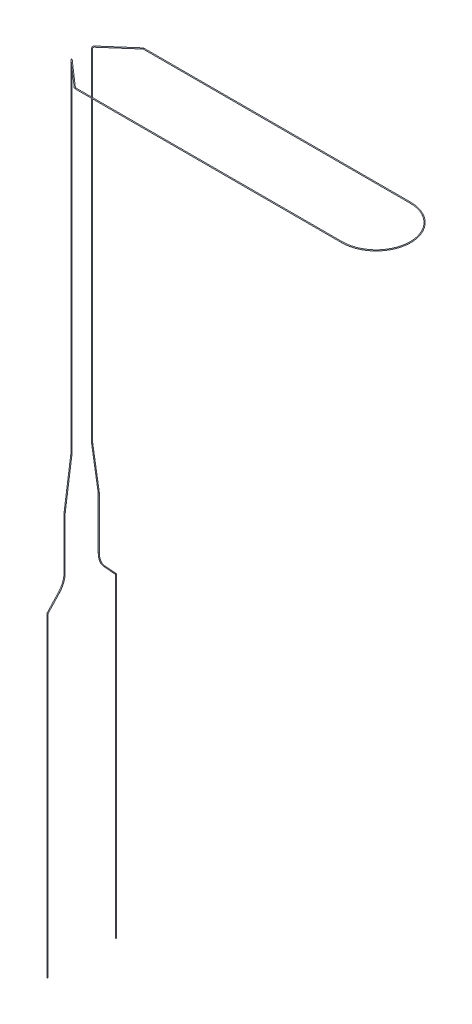
ISO-10303-21;
HEADER;
FILE_DESCRIPTION(('STEP AP214'),'2;1');
FILE_NAME('part.step','',(''),(''),'','','');
FILE_SCHEMA(('AUTOMOTIVE_DESIGN { 1 0 10303 214 1 1 1 1 }'));
ENDSEC;
DATA;
#1=APPLICATION_CONTEXT('core data for automotive mechanical design processes');
#2=APPLICATION_PROTOCOL_DEFINITION('international standard','automotive_design',2000,#1);
#3=PRODUCT_CONTEXT('',#1,'mechanical');
#4=PRODUCT('Part','Part','',(#3));
#5=PRODUCT_RELATED_PRODUCT_CATEGORY('part','',(#4));
#6=PRODUCT_DEFINITION_FORMATION('','',#4);
#7=PRODUCT_DEFINITION_CONTEXT('part definition',#1,'design');
#8=PRODUCT_DEFINITION('design','',#6,#7);
#9=PRODUCT_DEFINITION_SHAPE('','',#8);
#10=(LENGTH_UNIT() NAMED_UNIT(*) SI_UNIT(.MILLI.,.METRE.));
#11=(NAMED_UNIT(*) PLANE_ANGLE_UNIT() SI_UNIT($,.RADIAN.));
#12=(NAMED_UNIT(*) SI_UNIT($,.STERADIAN.) SOLID_ANGLE_UNIT());
#13=UNCERTAINTY_MEASURE_WITH_UNIT(LENGTH_MEASURE(1.E-05),#10,'distance_accuracy_value','');
#14=(GEOMETRIC_REPRESENTATION_CONTEXT(3) GLOBAL_UNCERTAINTY_ASSIGNED_CONTEXT((#13)) GLOBAL_UNIT_ASSIGNED_CONTEXT((#10,
#11,#12)) REPRESENTATION_CONTEXT('',''));
#15=CARTESIAN_POINT('',(0.,0.,0.));
#16=DIRECTION('',(0.,0.,1.));
#17=DIRECTION('',(1.,0.,0.));
#18=AXIS2_PLACEMENT_3D('',#15,#16,#17);
#19=CARTESIAN_POINT('',(0.,-200.,20.));
#20=DIRECTION('',(0.,-1.,0.));
#21=DIRECTION('',(-1.,0.,0.));
#22=AXIS2_PLACEMENT_3D('',#19,#20,#21);
#23=PLANE('',#22);
#24=CARTESIAN_POINT('',(0.,-200.,20.));
#25=DIRECTION('',(0.,-1.,0.));
#26=DIRECTION('',(-1.,0.,0.));
#27=AXIS2_PLACEMENT_3D('',#24,#25,#26);
#28=CIRCLE('',#27,0.25);
#29=CARTESIAN_POINT('',(-0.249999999999906,-200.,20.));
#30=VERTEX_POINT('',#29);
#31=EDGE_CURVE('E172',#30,#30,#28,.T.);
#32=ORIENTED_EDGE('',*,*,#31,.T.);
#33=EDGE_LOOP('',(#32));
#34=FACE_BOUND('',#33,.T.);
#35=ADVANCED_FACE('F49',(#34),#23,.T.);
#36=CARTESIAN_POINT('',(0.,-200.,-20.));
#37=DIRECTION('',(0.,1.,0.));
#38=DIRECTION('',(-1.,0.,0.));
#39=AXIS2_PLACEMENT_3D('',#36,#37,#38);
#40=PLANE('',#39);
#41=CARTESIAN_POINT('',(0.,-200.,-20.));
#42=DIRECTION('',(0.,1.,0.));
#43=DIRECTION('',(-1.,0.,0.));
#44=AXIS2_PLACEMENT_3D('',#41,#42,#43);
#45=CIRCLE('',#44,0.25);
#46=CARTESIAN_POINT('',(-0.249999999999906,-200.,-20.));
#47=VERTEX_POINT('',#46);
#48=EDGE_CURVE('E11',#47,#47,#45,.T.);
#49=ORIENTED_EDGE('',*,*,#48,.F.);
#50=EDGE_LOOP('',(#49));
#51=FACE_BOUND('',#50,.T.);
#52=ADVANCED_FACE('F181',(#51),#40,.F.);
#53=CARTESIAN_POINT('',(0.,-200.,20.));
#54=DIRECTION('',(0.,1.,0.));
#55=DIRECTION('',(-1.,0.,0.));
#56=AXIS2_PLACEMENT_3D('',#53,#54,#55);
#57=CYLINDRICAL_SURFACE('',#56,0.25);
#58=CARTESIAN_POINT('',(0.,-16.2259715403941,20.));
#59=DIRECTION('',(0.,-1.,0.));
#60=DIRECTION('',(-1.,0.,0.));
#61=AXIS2_PLACEMENT_3D('',#58,#59,#60);
#62=CIRCLE('',#61,0.25);
#63=CARTESIAN_POINT('',(0.,-16.2259715403941,20.25));
#64=VERTEX_POINT('',#63);
#65=EDGE_CURVE('E168',#64,#64,#62,.T.);
#66=ORIENTED_EDGE('',*,*,#65,.T.);
#67=EDGE_LOOP('',(#66));
#68=FACE_BOUND('',#67,.T.);
#69=ORIENTED_EDGE('',*,*,#31,.F.);
#70=EDGE_LOOP('',(#69));
#71=FACE_BOUND('',#70,.T.);
#72=ADVANCED_FACE('F178',(#68,#71),#57,.T.);
#73=CARTESIAN_POINT('',(0.,-16.2259715403941,19.));
#74=DIRECTION('',(-1.,0.,0.));
#75=DIRECTION('',(0.,0.,1.));
#76=AXIS2_PLACEMENT_3D('',#73,#74,#75);
#77=TOROIDAL_SURFACE('',#76,1.,0.25);
#78=CARTESIAN_POINT('',(0.,-15.5476836140616,19.7347962227662));
#79=DIRECTION('',(0.,-0.734796222766241,0.678287926332516));
#80=DIRECTION('',(-1.,0.,0.));
#81=AXIS2_PLACEMENT_3D('',#78,#79,#80);
#82=CIRCLE('',#81,0.25);
#83=CARTESIAN_POINT('',(0.,-15.3781116324784,19.9184952784578));
#84=VERTEX_POINT('',#83);
#85=EDGE_CURVE('E164',#84,#84,#82,.T.);
#86=CARTESIAN_POINT('',(0.,-16.2259715403941,19.));
#87=DIRECTION('',(-1.,0.,0.));
#88=DIRECTION('',(0.,0.,1.));
#89=AXIS2_PLACEMENT_3D('',#86,#87,#88);
#90=CIRCLE('',#89,1.25);
#91=EDGE_CURVE('',#64,#84,#90,.T.);
#92=ORIENTED_EDGE('',*,*,#65,.F.);
#93=ORIENTED_EDGE('',*,*,#85,.T.);
#94=ORIENTED_EDGE('',*,*,#91,.T.);
#95=ORIENTED_EDGE('',*,*,#91,.F.);
#96=EDGE_LOOP('',(#92,#94,#93,#95));
#97=FACE_BOUND('',#96,.T.);
#98=ADVANCED_FACE('F180',(#97),#77,.T.);
#99=CARTESIAN_POINT('',(0.,-15.5476836140616,19.7347962227662));
#100=DIRECTION('',(0.,0.734796222766239,-0.678287926332518));
#101=DIRECTION('',(0.,0.678287926332518,0.734796222766239));
#102=AXIS2_PLACEMENT_3D('',#99,#100,#101);
#103=CYLINDRICAL_SURFACE('',#102,0.25);
#104=CARTESIAN_POINT('',(0.,-8.44945511599021,13.1824453268051));
#105=DIRECTION('',(0.,-0.734796222766239,0.678287926332518));
#106=DIRECTION('',(-1.,0.,0.));
#107=AXIS2_PLACEMENT_3D('',#104,#105,#106);
#108=CIRCLE('',#107,0.25);
#109=CARTESIAN_POINT('',(0.,-8.61902709757335,12.9987462711136));
#110=VERTEX_POINT('',#109);
#111=EDGE_CURVE('E160',#110,#110,#108,.T.);
#112=ORIENTED_EDGE('',*,*,#111,.T.);
#113=EDGE_LOOP('',(#112));
#114=FACE_BOUND('',#113,.T.);
#115=ORIENTED_EDGE('',*,*,#85,.F.);
#116=EDGE_LOOP('',(#115));
#117=FACE_BOUND('',#116,.T.);
#118=ADVANCED_FACE('F188',(#114,#117),#103,.T.);
#119=CARTESIAN_POINT('',(0.,-0.309999999999999,22.));
#120=DIRECTION('',(1.,0.,0.));
#121=DIRECTION('',(0.,0.,-1.));
#122=AXIS2_PLACEMENT_3D('',#119,#120,#121);
#123=TOROIDAL_SURFACE('',#122,12.,0.25);
#124=CARTESIAN_POINT('',(0.,-0.310000000000005,10.));
#125=DIRECTION('',(0.,-1.,0.));
#126=DIRECTION('',(-1.,0.,0.));
#127=AXIS2_PLACEMENT_3D('',#124,#125,#126);
#128=CIRCLE('',#127,0.25);
#129=CARTESIAN_POINT('',(0.,-0.310000000000005,9.75));
#130=VERTEX_POINT('',#129);
#131=EDGE_CURVE('E156',#130,#130,#128,.T.);
#132=CARTESIAN_POINT('',(0.,-0.309999999999999,22.));
#133=DIRECTION('',(1.,0.,0.));
#134=DIRECTION('',(0.,0.,-1.));
#135=AXIS2_PLACEMENT_3D('',#132,#133,#134);
#136=CIRCLE('',#135,12.25);
#137=EDGE_CURVE('',#110,#130,#136,.T.);
#138=ORIENTED_EDGE('',*,*,#111,.F.);
#139=ORIENTED_EDGE('',*,*,#131,.T.);
#140=ORIENTED_EDGE('',*,*,#137,.T.);
#141=ORIENTED_EDGE('',*,*,#137,.F.);
#142=EDGE_LOOP('',(#138,#140,#139,#141));
#143=FACE_BOUND('',#142,.T.);
#144=ADVANCED_FACE('F293',(#143),#123,.T.);
#145=CARTESIAN_POINT('',(0.,-0.310000000000005,10.));
#146=DIRECTION('',(0.,1.,0.));
#147=DIRECTION('',(-1.,0.,0.));
#148=AXIS2_PLACEMENT_3D('',#145,#146,#147);
#149=CYLINDRICAL_SURFACE('',#148,0.25);
#150=CARTESIAN_POINT('',(0.,0.,10.));
#151=DIRECTION('',(0.,-1.,0.));
#152=DIRECTION('',(-1.,0.,0.));
#153=AXIS2_PLACEMENT_3D('',#150,#151,#152);
#154=CIRCLE('',#153,0.25);
#155=CARTESIAN_POINT('',(-0.249999999999996,0.,10.));
#156=VERTEX_POINT('',#155);
#157=EDGE_CURVE('E152',#156,#156,#154,.T.);
#158=ORIENTED_EDGE('',*,*,#157,.T.);
#159=EDGE_LOOP('',(#158));
#160=FACE_BOUND('',#159,.T.);
#161=ORIENTED_EDGE('',*,*,#131,.F.);
#162=EDGE_LOOP('',(#161));
#163=FACE_BOUND('',#162,.T.);
#164=ADVANCED_FACE('F289',(#160,#163),#149,.T.);
#165=CARTESIAN_POINT('',(0.,0.,10.));
#166=DIRECTION('',(0.,1.,0.));
#167=DIRECTION('',(-1.,0.,0.));
#168=AXIS2_PLACEMENT_3D('',#165,#166,#167);
#169=CYLINDRICAL_SURFACE('',#168,0.25);
#170=CARTESIAN_POINT('',(0.,29.2893218813453,10.));
#171=DIRECTION('',(0.,-1.,0.));
#172=DIRECTION('',(-1.,0.,0.));
#173=AXIS2_PLACEMENT_3D('',#170,#171,#172);
#174=CIRCLE('',#173,0.25);
#175=CARTESIAN_POINT('',(0.,29.2893218813453,10.25));
#176=VERTEX_POINT('',#175);
#177=EDGE_CURVE('E148',#176,#176,#174,.T.);
#178=ORIENTED_EDGE('',*,*,#177,.T.);
#179=EDGE_LOOP('',(#178));
#180=FACE_BOUND('',#179,.T.);
#181=ORIENTED_EDGE('',*,*,#157,.F.);
#182=EDGE_LOOP('',(#181));
#183=FACE_BOUND('',#182,.T.);
#184=ADVANCED_FACE('F285',(#180,#183),#169,.T.);
#185=CARTESIAN_POINT('',(0.,29.2893218813453,0.));
#186=DIRECTION('',(-1.,0.,0.));
#187=DIRECTION('',(0.,0.,1.));
#188=AXIS2_PLACEMENT_3D('',#185,#186,#187);
#189=TOROIDAL_SURFACE('',#188,10.,0.25);
#190=CARTESIAN_POINT('',(0.,30.7035354437183,9.89949493661167));
#191=DIRECTION('',(0.,-0.989949493661167,0.14142135623731));
#192=DIRECTION('',(-1.,0.,0.));
#193=AXIS2_PLACEMENT_3D('',#190,#191,#192);
#194=CIRCLE('',#193,0.25);
#195=CARTESIAN_POINT('',(0.,30.7388907827776,10.146982310027));
#196=VERTEX_POINT('',#195);
#197=EDGE_CURVE('E144',#196,#196,#194,.T.);
#198=CARTESIAN_POINT('',(0.,29.2893218813453,0.));
#199=DIRECTION('',(-1.,0.,0.));
#200=DIRECTION('',(0.,0.,1.));
#201=AXIS2_PLACEMENT_3D('',#198,#199,#200);
#202=CIRCLE('',#201,10.25);
#203=EDGE_CURVE('',#176,#196,#202,.T.);
#204=ORIENTED_EDGE('',*,*,#177,.F.);
#205=ORIENTED_EDGE('',*,*,#197,.T.);
#206=ORIENTED_EDGE('',*,*,#203,.T.);
#207=ORIENTED_EDGE('',*,*,#203,.F.);
#208=EDGE_LOOP('',(#204,#206,#205,#207));
#209=FACE_BOUND('',#208,.T.);
#210=ADVANCED_FACE('F281',(#209),#189,.T.);
#211=CARTESIAN_POINT('',(0.,30.7035354437183,9.89949493661167));
#212=DIRECTION('',(0.,0.989949493661166,-0.14142135623731));
#213=DIRECTION('',(0.,0.14142135623731,0.989949493661166));
#214=AXIS2_PLACEMENT_3D('',#211,#212,#213);
#215=CYLINDRICAL_SURFACE('',#214,0.25);
#216=CARTESIAN_POINT('',(0.,57.2964645562816,6.10050506338833));
#217=DIRECTION('',(0.,-0.989949493661167,0.14142135623731));
#218=DIRECTION('',(-1.,0.,0.));
#219=AXIS2_PLACEMENT_3D('',#216,#217,#218);
#220=CIRCLE('',#219,0.25);
#221=CARTESIAN_POINT('',(0.,57.2611092172223,5.85301768997304));
#222=VERTEX_POINT('',#221);
#223=EDGE_CURVE('E140',#222,#222,#220,.T.);
#224=ORIENTED_EDGE('',*,*,#223,.T.);
#225=EDGE_LOOP('',(#224));
#226=FACE_BOUND('',#225,.T.);
#227=ORIENTED_EDGE('',*,*,#197,.F.);
#228=EDGE_LOOP('',(#227));
#229=FACE_BOUND('',#228,.T.);
#230=ADVANCED_FACE('F277',(#226,#229),#215,.T.);
#231=CARTESIAN_POINT('',(0.,58.7106781186548,16.));
#232=DIRECTION('',(1.,0.,0.));
#233=DIRECTION('',(0.,0.,-1.));
#234=AXIS2_PLACEMENT_3D('',#231,#232,#233);
#235=TOROIDAL_SURFACE('',#234,9.99999999999999,0.25);
#236=CARTESIAN_POINT('',(0.,58.7106781186548,5.99999999999999));
#237=DIRECTION('',(0.,-1.,0.));
#238=DIRECTION('',(-1.,0.,0.));
#239=AXIS2_PLACEMENT_3D('',#236,#237,#238);
#240=CIRCLE('',#239,0.25);
#241=CARTESIAN_POINT('',(0.,58.7106781186548,5.75));
#242=VERTEX_POINT('',#241);
#243=EDGE_CURVE('E136',#242,#242,#240,.T.);
#244=CARTESIAN_POINT('',(0.,58.7106781186548,16.));
#245=DIRECTION('',(1.,0.,0.));
#246=DIRECTION('',(0.,0.,-1.));
#247=AXIS2_PLACEMENT_3D('',#244,#245,#246);
#248=CIRCLE('',#247,10.25);
#249=EDGE_CURVE('',#222,#242,#248,.T.);
#250=ORIENTED_EDGE('',*,*,#223,.F.);
#251=ORIENTED_EDGE('',*,*,#243,.T.);
#252=ORIENTED_EDGE('',*,*,#249,.T.);
#253=ORIENTED_EDGE('',*,*,#249,.F.);
#254=EDGE_LOOP('',(#250,#252,#251,#253));
#255=FACE_BOUND('',#254,.T.);
#256=ADVANCED_FACE('F273',(#255),#235,.T.);
#257=CARTESIAN_POINT('',(0.,58.7106781186548,5.99999999999999));
#258=DIRECTION('',(0.,1.,0.));
#259=DIRECTION('',(-1.,0.,0.));
#260=AXIS2_PLACEMENT_3D('',#257,#258,#259);
#261=CYLINDRICAL_SURFACE('',#260,0.25);
#262=CARTESIAN_POINT('',(0.,257.,6.));
#263=DIRECTION('',(0.,-1.,0.));
#264=DIRECTION('',(-1.,0.,0.));
#265=AXIS2_PLACEMENT_3D('',#262,#263,#264);
#266=CIRCLE('',#265,0.25);
#267=CARTESIAN_POINT('',(-0.188144173676715,257.,5.83537384803287));
#268=VERTEX_POINT('',#267);
#269=EDGE_CURVE('E132',#268,#268,#266,.T.);
#270=ORIENTED_EDGE('',*,*,#269,.T.);
#271=EDGE_LOOP('',(#270));
#272=FACE_BOUND('',#271,.T.);
#273=ORIENTED_EDGE('',*,*,#243,.F.);
#274=EDGE_LOOP('',(#273));
#275=FACE_BOUND('',#274,.T.);
#276=ADVANCED_FACE('F269',(#272,#275),#261,.T.);
#277=CARTESIAN_POINT('',(0.752576694706892,257.,6.65850460786851));
#278=DIRECTION('',(0.658504607868518,0.,-0.752576694706878));
#279=DIRECTION('',(-0.752576694706878,0.,-0.658504607868518));
#280=AXIS2_PLACEMENT_3D('',#277,#278,#279);
#281=TOROIDAL_SURFACE('',#280,1.,0.25);
#282=CARTESIAN_POINT('',(0.752576694706852,258.,6.65850460786852));
#283=DIRECTION('',(-0.752576694706878,0.,-0.658504607868518));
#284=DIRECTION('',(-0.433628318584071,0.752576694706878,0.495575221238938));
#285=AXIS2_PLACEMENT_3D('',#282,#283,#284);
#286=CIRCLE('',#285,0.25);
#287=CARTESIAN_POINT('',(0.752576694706842,258.25,6.65850460786852));
#288=VERTEX_POINT('',#287);
#289=EDGE_CURVE('E128',#288,#288,#286,.T.);
#290=CARTESIAN_POINT('',(0.752576694706892,257.,6.65850460786851));
#291=DIRECTION('',(0.658504607868518,0.,-0.752576694706878));
#292=DIRECTION('',(-0.752576694706878,0.,-0.658504607868518));
#293=AXIS2_PLACEMENT_3D('',#290,#291,#292);
#294=CIRCLE('',#293,1.25);
#295=EDGE_CURVE('',#268,#288,#294,.T.);
#296=ORIENTED_EDGE('',*,*,#269,.F.);
#297=ORIENTED_EDGE('',*,*,#289,.T.);
#298=ORIENTED_EDGE('',*,*,#295,.T.);
#299=ORIENTED_EDGE('',*,*,#295,.F.);
#300=EDGE_LOOP('',(#296,#298,#297,#299));
#301=FACE_BOUND('',#300,.T.);
#302=ADVANCED_FACE('F265',(#301),#281,.T.);
#303=CARTESIAN_POINT('',(0.75257669470688,258.,6.65850460786849));
#304=DIRECTION('',(0.752576694706878,0.,0.658504607868518));
#305=DIRECTION('',(0.658504607868518,0.,-0.752576694706878));
#306=AXIS2_PLACEMENT_3D('',#303,#304,#305);
#307=CYLINDRICAL_SURFACE('',#306,0.25);
#308=CARTESIAN_POINT('',(15.7172305082364,258.,19.7525766947069));
#309=DIRECTION('',(-0.752576694706878,0.,-0.658504607868518));
#310=DIRECTION('',(-0.433628318584071,0.752576694706878,0.495575221238938));
#311=AXIS2_PLACEMENT_3D('',#308,#309,#310);
#312=CIRCLE('',#311,0.25);
#313=CARTESIAN_POINT('',(15.5526043562693,258.,19.9407208683836));
#314=VERTEX_POINT('',#313);
#315=EDGE_CURVE('E124',#314,#314,#312,.T.);
#316=ORIENTED_EDGE('',*,*,#315,.T.);
#317=EDGE_LOOP('',(#316));
#318=FACE_BOUND('',#317,.T.);
#319=ORIENTED_EDGE('',*,*,#289,.F.);
#320=EDGE_LOOP('',(#319));
#321=FACE_BOUND('',#320,.T.);
#322=ADVANCED_FACE('F261',(#318,#321),#307,.T.);
#323=CARTESIAN_POINT('',(16.375735116105,258.,19.));
#324=DIRECTION('',(0.,1.,0.));
#325=DIRECTION('',(0.,0.,1.));
#326=AXIS2_PLACEMENT_3D('',#323,#324,#325);
#327=TOROIDAL_SURFACE('',#326,1.,0.25);
#328=CARTESIAN_POINT('',(16.375735116105,258.,20.));
#329=DIRECTION('',(-1.,0.,0.));
#330=DIRECTION('',(0.,0.752576694706878,0.658504607868518));
#331=AXIS2_PLACEMENT_3D('',#328,#329,#330);
#332=CIRCLE('',#331,0.25);
#333=CARTESIAN_POINT('',(16.375735116105,258.,20.25));
#334=VERTEX_POINT('',#333);
#335=EDGE_CURVE('E120',#334,#334,#332,.T.);
#336=CARTESIAN_POINT('',(16.375735116105,258.,19.));
#337=DIRECTION('',(0.,1.,0.));
#338=DIRECTION('',(0.,0.,1.));
#339=AXIS2_PLACEMENT_3D('',#336,#337,#338);
#340=CIRCLE('',#339,1.25);
#341=EDGE_CURVE('',#314,#334,#340,.T.);
#342=ORIENTED_EDGE('',*,*,#315,.F.);
#343=ORIENTED_EDGE('',*,*,#335,.T.);
#344=ORIENTED_EDGE('',*,*,#341,.T.);
#345=ORIENTED_EDGE('',*,*,#341,.F.);
#346=EDGE_LOOP('',(#342,#344,#343,#345));
#347=FACE_BOUND('',#346,.T.);
#348=ADVANCED_FACE('F257',(#347),#327,.T.);
#349=CARTESIAN_POINT('',(16.375735116105,258.,20.));
#350=DIRECTION('',(1.,0.,0.));
#351=DIRECTION('',(0.,0.,-1.));
#352=AXIS2_PLACEMENT_3D('',#349,#350,#351);
#353=CYLINDRICAL_SURFACE('',#352,0.25);
#354=CARTESIAN_POINT('',(172.,258.,20.));
#355=DIRECTION('',(-1.,0.,0.));
#356=DIRECTION('',(0.,0.752576694706878,0.658504607868518));
#357=AXIS2_PLACEMENT_3D('',#354,#355,#356);
#358=CIRCLE('',#357,0.25);
#359=CARTESIAN_POINT('',(172.,258.,20.25));
#360=VERTEX_POINT('',#359);
#361=EDGE_CURVE('E116',#360,#360,#358,.T.);
#362=ORIENTED_EDGE('',*,*,#361,.T.);
#363=EDGE_LOOP('',(#362));
#364=FACE_BOUND('',#363,.T.);
#365=ORIENTED_EDGE('',*,*,#335,.F.);
#366=EDGE_LOOP('',(#365));
#367=FACE_BOUND('',#366,.T.);
#368=ADVANCED_FACE('F253',(#364,#367),#353,.T.);
#369=CARTESIAN_POINT('',(172.,258.,0.));
#370=DIRECTION('',(0.,1.,0.));
#371=DIRECTION('',(0.,0.,1.));
#372=AXIS2_PLACEMENT_3D('',#369,#370,#371);
#373=TOROIDAL_SURFACE('',#372,20.,0.25);
#374=CARTESIAN_POINT('',(172.,258.,-20.));
#375=DIRECTION('',(1.,0.,0.));
#376=DIRECTION('',(0.,0.752576694706878,-0.658504607868518));
#377=AXIS2_PLACEMENT_3D('',#374,#375,#376);
#378=CIRCLE('',#377,0.25);
#379=CARTESIAN_POINT('',(172.,258.,-20.25));
#380=VERTEX_POINT('',#379);
#381=EDGE_CURVE('E112',#380,#380,#378,.T.);
#382=CARTESIAN_POINT('',(172.,258.,0.));
#383=DIRECTION('',(0.,1.,0.));
#384=DIRECTION('',(0.,0.,1.));
#385=AXIS2_PLACEMENT_3D('',#382,#383,#384);
#386=CIRCLE('',#385,20.25);
#387=EDGE_CURVE('',#360,#380,#386,.T.);
#388=ORIENTED_EDGE('',*,*,#361,.F.);
#389=ORIENTED_EDGE('',*,*,#381,.T.);
#390=ORIENTED_EDGE('',*,*,#387,.T.);
#391=ORIENTED_EDGE('',*,*,#387,.F.);
#392=EDGE_LOOP('',(#388,#390,#389,#391));
#393=FACE_BOUND('',#392,.T.);
#394=ADVANCED_FACE('F249',(#393),#373,.T.);
#395=CARTESIAN_POINT('',(172.,258.,-20.));
#396=DIRECTION('',(-1.,0.,0.));
#397=DIRECTION('',(0.,0.,1.));
#398=AXIS2_PLACEMENT_3D('',#395,#396,#397);
#399=CYLINDRICAL_SURFACE('',#398,0.25);
#400=CARTESIAN_POINT('',(16.375735116105,258.,-20.));
#401=DIRECTION('',(1.,0.,0.));
#402=DIRECTION('',(0.,0.752576694706878,-0.658504607868518));
#403=AXIS2_PLACEMENT_3D('',#400,#401,#402);
#404=CIRCLE('',#403,0.25);
#405=CARTESIAN_POINT('',(16.375735116105,258.,-20.25));
#406=VERTEX_POINT('',#405);
#407=EDGE_CURVE('E108',#406,#406,#404,.T.);
#408=ORIENTED_EDGE('',*,*,#407,.T.);
#409=EDGE_LOOP('',(#408));
#410=FACE_BOUND('',#409,.T.);
#411=ORIENTED_EDGE('',*,*,#381,.F.);
#412=EDGE_LOOP('',(#411));
#413=FACE_BOUND('',#412,.T.);
#414=ADVANCED_FACE('F245',(#410,#413),#399,.T.);
#415=CARTESIAN_POINT('',(16.375735116105,258.,-19.));
#416=DIRECTION('',(0.,1.,0.));
#417=DIRECTION('',(0.,0.,1.));
#418=AXIS2_PLACEMENT_3D('',#415,#416,#417);
#419=TOROIDAL_SURFACE('',#418,1.,0.25);
#420=CARTESIAN_POINT('',(15.7172305082365,258.,-19.7525766947069));
#421=DIRECTION('',(0.752576694706879,0.,-0.658504607868516));
#422=DIRECTION('',(-0.433628318584069,0.752576694706878,-0.495575221238939));
#423=AXIS2_PLACEMENT_3D('',#420,#421,#422);
#424=CIRCLE('',#423,0.25);
#425=CARTESIAN_POINT('',(15.5526043562693,258.,-19.9407208683836));
#426=VERTEX_POINT('',#425);
#427=EDGE_CURVE('E104',#426,#426,#424,.T.);
#428=CARTESIAN_POINT('',(16.375735116105,258.,-19.));
#429=DIRECTION('',(0.,1.,0.));
#430=DIRECTION('',(0.,0.,1.));
#431=AXIS2_PLACEMENT_3D('',#428,#429,#430);
#432=CIRCLE('',#431,1.25);
#433=EDGE_CURVE('',#406,#426,#432,.T.);
#434=ORIENTED_EDGE('',*,*,#407,.F.);
#435=ORIENTED_EDGE('',*,*,#427,.T.);
#436=ORIENTED_EDGE('',*,*,#433,.T.);
#437=ORIENTED_EDGE('',*,*,#433,.F.);
#438=EDGE_LOOP('',(#434,#436,#435,#437));
#439=FACE_BOUND('',#438,.T.);
#440=ADVANCED_FACE('F241',(#439),#419,.T.);
#441=CARTESIAN_POINT('',(15.7172305082365,258.,-19.7525766947069));
#442=DIRECTION('',(-0.752576694706878,0.,0.658504607868518));
#443=DIRECTION('',(0.658504607868518,0.,0.752576694706878));
#444=AXIS2_PLACEMENT_3D('',#441,#442,#443);
#445=CYLINDRICAL_SURFACE('',#444,0.25);
#446=CARTESIAN_POINT('',(0.75257669470688,258.,-6.65850460786852));
#447=DIRECTION('',(0.752576694706878,0.,-0.658504607868518));
#448=DIRECTION('',(-0.433628318584071,0.752576694706878,-0.495575221238938));
#449=AXIS2_PLACEMENT_3D('',#446,#447,#448);
#450=CIRCLE('',#449,0.25);
#451=CARTESIAN_POINT('',(0.752576694706879,258.25,-6.65850460786851));
#452=VERTEX_POINT('',#451);
#453=EDGE_CURVE('E100',#452,#452,#450,.T.);
#454=ORIENTED_EDGE('',*,*,#453,.T.);
#455=EDGE_LOOP('',(#454));
#456=FACE_BOUND('',#455,.T.);
#457=ORIENTED_EDGE('',*,*,#427,.F.);
#458=EDGE_LOOP('',(#457));
#459=FACE_BOUND('',#458,.T.);
#460=ADVANCED_FACE('F237',(#456,#459),#445,.T.);
#461=CARTESIAN_POINT('',(0.752576694706885,257.,-6.65850460786852));
#462=DIRECTION('',(0.658504607868518,0.,0.752576694706878));
#463=DIRECTION('',(0.752576694706878,0.,-0.658504607868518));
#464=AXIS2_PLACEMENT_3D('',#461,#462,#463);
#465=TOROIDAL_SURFACE('',#464,1.,0.25);
#466=CARTESIAN_POINT('',(1.1277935896531E-13,257.,-5.99999999999999));
#467=DIRECTION('',(0.,1.,0.));
#468=DIRECTION('',(-1.,0.,0.));
#469=AXIS2_PLACEMENT_3D('',#466,#467,#468);
#470=CIRCLE('',#469,0.25);
#471=CARTESIAN_POINT('',(-0.188144173676648,257.,-5.8353738480328));
#472=VERTEX_POINT('',#471);
#473=EDGE_CURVE('E96',#472,#472,#470,.T.);
#474=CARTESIAN_POINT('',(0.752576694706885,257.,-6.65850460786852));
#475=DIRECTION('',(0.658504607868518,0.,0.752576694706878));
#476=DIRECTION('',(0.752576694706878,0.,-0.658504607868518));
#477=AXIS2_PLACEMENT_3D('',#474,#475,#476);
#478=CIRCLE('',#477,1.25);
#479=EDGE_CURVE('',#452,#472,#478,.T.);
#480=ORIENTED_EDGE('',*,*,#453,.F.);
#481=ORIENTED_EDGE('',*,*,#473,.T.);
#482=ORIENTED_EDGE('',*,*,#479,.T.);
#483=ORIENTED_EDGE('',*,*,#479,.F.);
#484=EDGE_LOOP('',(#480,#482,#481,#483));
#485=FACE_BOUND('',#484,.T.);
#486=ADVANCED_FACE('F233',(#485),#465,.T.);
#487=CARTESIAN_POINT('',(0.,257.,-6.00000000000001));
#488=DIRECTION('',(0.,-1.,0.));
#489=DIRECTION('',(1.,0.,0.));
#490=AXIS2_PLACEMENT_3D('',#487,#488,#489);
#491=CYLINDRICAL_SURFACE('',#490,0.25);
#492=CARTESIAN_POINT('',(1.05935164965347E-13,58.7106781186548,-6.));
#493=DIRECTION('',(0.,1.,0.));
#494=DIRECTION('',(-1.,0.,0.));
#495=AXIS2_PLACEMENT_3D('',#492,#493,#494);
#496=CIRCLE('',#495,0.25);
#497=CARTESIAN_POINT('',(1.05921924600348E-13,58.7106781186548,-5.7500000000004));
#498=VERTEX_POINT('',#497);
#499=EDGE_CURVE('E92',#498,#498,#496,.T.);
#500=ORIENTED_EDGE('',*,*,#499,.T.);
#501=EDGE_LOOP('',(#500));
#502=FACE_BOUND('',#501,.T.);
#503=ORIENTED_EDGE('',*,*,#473,.F.);
#504=EDGE_LOOP('',(#503));
#505=FACE_BOUND('',#504,.T.);
#506=ADVANCED_FACE('F229',(#502,#505),#491,.T.);
#507=CARTESIAN_POINT('',(1.06464779565288E-13,58.7106781186548,-16.));
#508=DIRECTION('',(1.,0.,0.));
#509=DIRECTION('',(0.,0.,-1.));
#510=AXIS2_PLACEMENT_3D('',#507,#508,#509);
#511=TOROIDAL_SURFACE('',#510,9.99999999999959,0.25);
#512=CARTESIAN_POINT('',(0.,57.2964645562816,-6.10050506338833));
#513=DIRECTION('',(0.,0.989949493661166,0.14142135623731));
#514=DIRECTION('',(-1.,0.,0.));
#515=AXIS2_PLACEMENT_3D('',#512,#513,#514);
#516=CIRCLE('',#515,0.25);
#517=CARTESIAN_POINT('',(0.,57.2611092172224,-5.85301768997345));
#518=VERTEX_POINT('',#517);
#519=EDGE_CURVE('E88',#518,#518,#516,.T.);
#520=CARTESIAN_POINT('',(1.06464779565288E-13,58.7106781186548,-16.));
#521=DIRECTION('',(1.,0.,0.));
#522=DIRECTION('',(0.,0.,-1.));
#523=AXIS2_PLACEMENT_3D('',#520,#521,#522);
#524=CIRCLE('',#523,10.2499999999996);
#525=EDGE_CURVE('',#498,#518,#524,.T.);
#526=ORIENTED_EDGE('',*,*,#499,.F.);
#527=ORIENTED_EDGE('',*,*,#519,.T.);
#528=ORIENTED_EDGE('',*,*,#525,.T.);
#529=ORIENTED_EDGE('',*,*,#525,.F.);
#530=EDGE_LOOP('',(#526,#528,#527,#529));
#531=FACE_BOUND('',#530,.T.);
#532=ADVANCED_FACE('F225',(#531),#511,.T.);
#533=CARTESIAN_POINT('',(0.,57.2964645562816,-6.10050506338833));
#534=DIRECTION('',(0.,-0.989949493661166,-0.14142135623731));
#535=DIRECTION('',(0.,0.14142135623731,-0.989949493661166));
#536=AXIS2_PLACEMENT_3D('',#533,#534,#535);
#537=CYLINDRICAL_SURFACE('',#536,0.25);
#538=CARTESIAN_POINT('',(0.,30.7035354437183,-9.89949493661167));
#539=DIRECTION('',(0.,0.989949493661166,0.14142135623731));
#540=DIRECTION('',(-1.,0.,0.));
#541=AXIS2_PLACEMENT_3D('',#538,#539,#540);
#542=CIRCLE('',#541,0.25);
#543=CARTESIAN_POINT('',(0.,30.7388907827777,-10.146982310027));
#544=VERTEX_POINT('',#543);
#545=EDGE_CURVE('E84',#544,#544,#542,.T.);
#546=ORIENTED_EDGE('',*,*,#545,.T.);
#547=EDGE_LOOP('',(#546));
#548=FACE_BOUND('',#547,.T.);
#549=ORIENTED_EDGE('',*,*,#519,.F.);
#550=EDGE_LOOP('',(#549));
#551=FACE_BOUND('',#550,.T.);
#552=ADVANCED_FACE('F221',(#548,#551),#537,.T.);
#553=CARTESIAN_POINT('',(0.,29.2893218813453,0.));
#554=DIRECTION('',(-1.,0.,0.));
#555=DIRECTION('',(0.,0.,1.));
#556=AXIS2_PLACEMENT_3D('',#553,#554,#555);
#557=TOROIDAL_SURFACE('',#556,10.,0.25);
#558=CARTESIAN_POINT('',(1.04244333516037E-13,29.2893218813453,-10.));
#559=DIRECTION('',(0.,1.,0.));
#560=DIRECTION('',(-1.,0.,0.));
#561=AXIS2_PLACEMENT_3D('',#558,#559,#560);
#562=CIRCLE('',#561,0.25);
#563=CARTESIAN_POINT('',(1.06658651138312E-13,29.2893218813453,-10.25));
#564=VERTEX_POINT('',#563);
#565=EDGE_CURVE('E80',#564,#564,#562,.T.);
#566=CARTESIAN_POINT('',(0.,29.2893218813453,0.));
#567=DIRECTION('',(-1.,0.,0.));
#568=DIRECTION('',(0.,0.,1.));
#569=AXIS2_PLACEMENT_3D('',#566,#567,#568);
#570=CIRCLE('',#569,10.25);
#571=EDGE_CURVE('',#544,#564,#570,.T.);
#572=ORIENTED_EDGE('',*,*,#545,.F.);
#573=ORIENTED_EDGE('',*,*,#565,.T.);
#574=ORIENTED_EDGE('',*,*,#571,.T.);
#575=ORIENTED_EDGE('',*,*,#571,.F.);
#576=EDGE_LOOP('',(#572,#574,#573,#575));
#577=FACE_BOUND('',#576,.T.);
#578=ADVANCED_FACE('F217',(#577),#557,.T.);
#579=CARTESIAN_POINT('',(1.3043691201314E-13,29.2893218813453,-10.));
#580=DIRECTION('',(0.,-1.,0.));
#581=DIRECTION('',(1.,0.,0.));
#582=AXIS2_PLACEMENT_3D('',#579,#580,#581);
#583=CYLINDRICAL_SURFACE('',#582,0.25);
#584=CARTESIAN_POINT('',(1.2660109770062E-13,0.,-10.));
#585=DIRECTION('',(0.,1.,0.));
#586=DIRECTION('',(-1.,0.,0.));
#587=AXIS2_PLACEMENT_3D('',#584,#585,#586);
#588=CIRCLE('',#587,0.25);
#589=CARTESIAN_POINT('',(-0.249999999999873,0.,-10.));
#590=VERTEX_POINT('',#589);
#591=EDGE_CURVE('E76',#590,#590,#588,.T.);
#592=ORIENTED_EDGE('',*,*,#591,.T.);
#593=EDGE_LOOP('',(#592));
#594=FACE_BOUND('',#593,.T.);
#595=ORIENTED_EDGE('',*,*,#565,.F.);
#596=EDGE_LOOP('',(#595));
#597=FACE_BOUND('',#596,.T.);
#598=ADVANCED_FACE('F213',(#594,#597),#583,.T.);
#599=CARTESIAN_POINT('',(-2.07671401586575E-12,0.,-10.));
#600=DIRECTION('',(0.,-1.,0.));
#601=DIRECTION('',(1.,0.,0.));
#602=AXIS2_PLACEMENT_3D('',#599,#600,#601);
#603=CYLINDRICAL_SURFACE('',#602,0.25);
#604=CARTESIAN_POINT('',(-2.0733394759364E-12,-0.310000000000005,-10.));
#605=DIRECTION('',(0.,1.,0.));
#606=DIRECTION('',(-1.,0.,0.));
#607=AXIS2_PLACEMENT_3D('',#604,#605,#606);
#608=CIRCLE('',#607,0.25);
#609=CARTESIAN_POINT('',(-2.11877514369186E-12,-0.310000000000005,-9.75));
#610=VERTEX_POINT('',#609);
#611=EDGE_CURVE('E72',#610,#610,#608,.T.);
#612=ORIENTED_EDGE('',*,*,#611,.T.);
#613=EDGE_LOOP('',(#612));
#614=FACE_BOUND('',#613,.T.);
#615=ORIENTED_EDGE('',*,*,#591,.F.);
#616=EDGE_LOOP('',(#615));
#617=FACE_BOUND('',#616,.T.);
#618=ADVANCED_FACE('F209',(#614,#617),#603,.T.);
#619=CARTESIAN_POINT('',(1.07572576325839E-13,-0.31,-22.));
#620=DIRECTION('',(1.,0.,0.));
#621=DIRECTION('',(0.,0.,-1.));
#622=AXIS2_PLACEMENT_3D('',#619,#620,#621);
#623=TOROIDAL_SURFACE('',#622,12.,0.25);
#624=CARTESIAN_POINT('',(0.,-8.44945511599021,-13.1824453268051));
#625=DIRECTION('',(0.,0.734796222766239,0.678287926332518));
#626=DIRECTION('',(-1.,0.,0.));
#627=AXIS2_PLACEMENT_3D('',#624,#625,#626);
#628=CIRCLE('',#627,0.25);
#629=CARTESIAN_POINT('',(0.,-8.61902709757334,-12.9987462711136));
#630=VERTEX_POINT('',#629);
#631=EDGE_CURVE('E66',#630,#630,#628,.T.);
#632=CARTESIAN_POINT('',(1.07572576325839E-13,-0.31,-22.));
#633=DIRECTION('',(1.,0.,0.));
#634=DIRECTION('',(0.,0.,-1.));
#635=AXIS2_PLACEMENT_3D('',#632,#633,#634);
#636=CIRCLE('',#635,12.25);
#637=EDGE_CURVE('',#610,#630,#636,.T.);
#638=ORIENTED_EDGE('',*,*,#611,.F.);
#639=ORIENTED_EDGE('',*,*,#631,.T.);
#640=ORIENTED_EDGE('',*,*,#637,.T.);
#641=ORIENTED_EDGE('',*,*,#637,.F.);
#642=EDGE_LOOP('',(#638,#640,#639,#641));
#643=FACE_BOUND('',#642,.T.);
#644=ADVANCED_FACE('F205',(#643),#623,.T.);
#645=CARTESIAN_POINT('',(0.,-8.44945511599021,-13.1824453268051));
#646=DIRECTION('',(0.,-0.734796222766239,-0.678287926332518));
#647=DIRECTION('',(0.,0.678287926332518,-0.734796222766239));
#648=AXIS2_PLACEMENT_3D('',#645,#646,#647);
#649=CYLINDRICAL_SURFACE('',#648,0.25);
#650=CARTESIAN_POINT('',(0.,-15.5476836140616,-19.7347962227662));
#651=DIRECTION('',(0.,0.734796222766239,0.678287926332518));
#652=DIRECTION('',(-1.,0.,0.));
#653=AXIS2_PLACEMENT_3D('',#650,#651,#652);
#654=CIRCLE('',#653,0.25);
#655=CARTESIAN_POINT('',(0.,-15.3781116324784,-19.9184952784578));
#656=VERTEX_POINT('',#655);
#657=EDGE_CURVE('E61',#656,#656,#654,.T.);
#658=ORIENTED_EDGE('',*,*,#657,.T.);
#659=EDGE_LOOP('',(#658));
#660=FACE_BOUND('',#659,.T.);
#661=ORIENTED_EDGE('',*,*,#631,.F.);
#662=EDGE_LOOP('',(#661));
#663=FACE_BOUND('',#662,.T.);
#664=ADVANCED_FACE('F199',(#660,#663),#649,.T.);
#665=CARTESIAN_POINT('',(0.,-16.2259715403941,-19.));
#666=DIRECTION('',(-1.,0.,0.));
#667=DIRECTION('',(0.,0.,1.));
#668=AXIS2_PLACEMENT_3D('',#665,#666,#667);
#669=TOROIDAL_SURFACE('',#668,1.,0.25);
#670=CARTESIAN_POINT('',(1.00485765984754E-13,-16.2259715403941,-20.));
#671=DIRECTION('',(0.,1.,0.));
#672=DIRECTION('',(-1.,0.,0.));
#673=AXIS2_PLACEMENT_3D('',#670,#671,#672);
#674=CIRCLE('',#673,0.25);
#675=CARTESIAN_POINT('',(1.24628942207504E-13,-16.2259715403941,-20.25));
#676=VERTEX_POINT('',#675);
#677=EDGE_CURVE('E56',#676,#676,#674,.T.);
#678=CARTESIAN_POINT('',(0.,-16.2259715403941,-19.));
#679=DIRECTION('',(-1.,0.,0.));
#680=DIRECTION('',(0.,0.,1.));
#681=AXIS2_PLACEMENT_3D('',#678,#679,#680);
#682=CIRCLE('',#681,1.25);
#683=EDGE_CURVE('',#656,#676,#682,.T.);
#684=ORIENTED_EDGE('',*,*,#657,.F.);
#685=ORIENTED_EDGE('',*,*,#677,.T.);
#686=ORIENTED_EDGE('',*,*,#683,.T.);
#687=ORIENTED_EDGE('',*,*,#683,.F.);
#688=EDGE_LOOP('',(#684,#686,#685,#687));
#689=FACE_BOUND('',#688,.T.);
#690=ADVANCED_FACE('F194',(#689),#669,.T.);
#691=CARTESIAN_POINT('',(0.,-16.2259715403941,-20.));
#692=DIRECTION('',(0.,-1.,0.));
#693=DIRECTION('',(1.,0.,0.));
#694=AXIS2_PLACEMENT_3D('',#691,#692,#693);
#695=CYLINDRICAL_SURFACE('',#694,0.25);
#696=ORIENTED_EDGE('',*,*,#48,.T.);
#697=EDGE_LOOP('',(#696));
#698=FACE_BOUND('',#697,.T.);
#699=ORIENTED_EDGE('',*,*,#677,.F.);
#700=EDGE_LOOP('',(#699));
#701=FACE_BOUND('',#700,.T.);
#702=ADVANCED_FACE('F192',(#698,#701),#695,.T.);
#703=CLOSED_SHELL('',(#35,#52,#72,#98,#118,#144,#164,#184,#210,#230,#256,#276,#302,#322,#348,
#368,#394,#414,#440,#460,#486,#506,#532,#552,#578,#598,#618,#644,#664,#690,#702));
#704=MANIFOLD_SOLID_BREP('B2',#703);
#705=ADVANCED_BREP_SHAPE_REPRESENTATION('',(#18,#704),#14);
#706=SHAPE_DEFINITION_REPRESENTATION(#9,#705);
ENDSEC;
END-ISO-10303-21;
